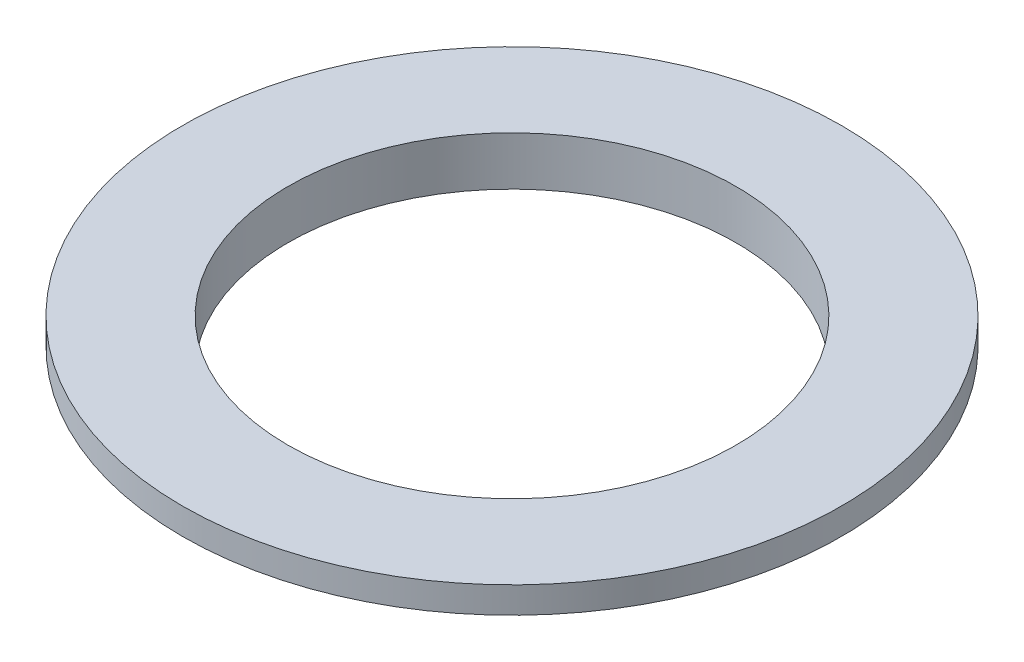
ISO-10303-21;
HEADER;
FILE_DESCRIPTION(('STEP AP214'),'2;1');
FILE_NAME('part.step','',(''),(''),'','','');
FILE_SCHEMA(('AUTOMOTIVE_DESIGN { 1 0 10303 214 1 1 1 1 }'));
ENDSEC;
DATA;
#1=APPLICATION_CONTEXT('core data for automotive mechanical design processes');
#2=APPLICATION_PROTOCOL_DEFINITION('international standard','automotive_design',2000,#1);
#3=PRODUCT_CONTEXT('',#1,'mechanical');
#4=PRODUCT('Part','Part','',(#3));
#5=PRODUCT_RELATED_PRODUCT_CATEGORY('part','',(#4));
#6=PRODUCT_DEFINITION_FORMATION('','',#4);
#7=PRODUCT_DEFINITION_CONTEXT('part definition',#1,'design');
#8=PRODUCT_DEFINITION('design','',#6,#7);
#9=PRODUCT_DEFINITION_SHAPE('','',#8);
#10=(LENGTH_UNIT() NAMED_UNIT(*) SI_UNIT(.MILLI.,.METRE.));
#11=(NAMED_UNIT(*) PLANE_ANGLE_UNIT() SI_UNIT($,.RADIAN.));
#12=(NAMED_UNIT(*) SI_UNIT($,.STERADIAN.) SOLID_ANGLE_UNIT());
#13=UNCERTAINTY_MEASURE_WITH_UNIT(LENGTH_MEASURE(1.E-05),#10,'distance_accuracy_value','');
#14=(GEOMETRIC_REPRESENTATION_CONTEXT(3) GLOBAL_UNCERTAINTY_ASSIGNED_CONTEXT((#13)) GLOBAL_UNIT_ASSIGNED_CONTEXT((#10,
#11,#12)) REPRESENTATION_CONTEXT('',''));
#15=CARTESIAN_POINT('',(0.,0.,0.));
#16=DIRECTION('',(0.,0.,1.));
#17=DIRECTION('',(1.,0.,0.));
#18=AXIS2_PLACEMENT_3D('',#15,#16,#17);
#19=CARTESIAN_POINT('',(0.,1.27,0.));
#20=DIRECTION('',(0.,-1.,0.));
#21=DIRECTION('',(0.,0.,-1.));
#22=AXIS2_PLACEMENT_3D('',#19,#20,#21);
#23=CYLINDRICAL_SURFACE('',#22,21.59);
#24=CARTESIAN_POINT('',(0.,1.27,0.));
#25=DIRECTION('',(0.,1.,0.));
#26=DIRECTION('',(0.,0.,1.));
#27=AXIS2_PLACEMENT_3D('',#24,#25,#26);
#28=CIRCLE('',#27,21.59);
#29=CARTESIAN_POINT('',(0.,1.27,21.59));
#30=VERTEX_POINT('',#29);
#31=EDGE_CURVE('E46',#30,#30,#28,.T.);
#32=ORIENTED_EDGE('',*,*,#31,.T.);
#33=EDGE_LOOP('',(#32));
#34=FACE_BOUND('',#33,.T.);
#35=CARTESIAN_POINT('',(0.,-3.429,0.));
#36=DIRECTION('',(0.,1.,0.));
#37=DIRECTION('',(0.,0.,1.));
#38=AXIS2_PLACEMENT_3D('',#35,#36,#37);
#39=CIRCLE('',#38,21.59);
#40=CARTESIAN_POINT('',(0.,-3.429,21.59));
#41=VERTEX_POINT('',#40);
#42=EDGE_CURVE('E56',#41,#41,#39,.T.);
#43=ORIENTED_EDGE('',*,*,#42,.F.);
#44=EDGE_LOOP('',(#43));
#45=FACE_BOUND('',#44,.T.);
#46=ADVANCED_FACE('F39',(#34,#45),#23,.F.);
#47=CARTESIAN_POINT('',(0.,1.27,0.));
#48=DIRECTION('',(0.,-1.,0.));
#49=DIRECTION('',(0.,0.,-1.));
#50=AXIS2_PLACEMENT_3D('',#47,#48,#49);
#51=CYLINDRICAL_SURFACE('',#50,31.75);
#52=CARTESIAN_POINT('',(0.,1.27,0.));
#53=DIRECTION('',(0.,1.,0.));
#54=DIRECTION('',(0.,0.,1.));
#55=AXIS2_PLACEMENT_3D('',#52,#53,#54);
#56=CIRCLE('',#55,31.75);
#57=CARTESIAN_POINT('',(0.,1.27,31.75));
#58=VERTEX_POINT('',#57);
#59=EDGE_CURVE('E11',#58,#58,#56,.T.);
#60=ORIENTED_EDGE('',*,*,#59,.F.);
#61=EDGE_LOOP('',(#60));
#62=FACE_BOUND('',#61,.T.);
#63=CARTESIAN_POINT('',(0.,-1.27,0.));
#64=DIRECTION('',(0.,1.,0.));
#65=DIRECTION('',(0.,0.,1.));
#66=AXIS2_PLACEMENT_3D('',#63,#64,#65);
#67=CIRCLE('',#66,31.75);
#68=CARTESIAN_POINT('',(0.,-1.27,31.75));
#69=VERTEX_POINT('',#68);
#70=EDGE_CURVE('E42',#69,#69,#67,.T.);
#71=ORIENTED_EDGE('',*,*,#70,.T.);
#72=EDGE_LOOP('',(#71));
#73=FACE_BOUND('',#72,.T.);
#74=ADVANCED_FACE('F66',(#62,#73),#51,.T.);
#75=CARTESIAN_POINT('',(0.,1.27,0.));
#76=DIRECTION('',(0.,1.,0.));
#77=DIRECTION('',(0.,0.,1.));
#78=AXIS2_PLACEMENT_3D('',#75,#76,#77);
#79=PLANE('',#78);
#80=ORIENTED_EDGE('',*,*,#31,.F.);
#81=EDGE_LOOP('',(#80));
#82=FACE_BOUND('',#81,.T.);
#83=ORIENTED_EDGE('',*,*,#59,.T.);
#84=EDGE_LOOP('',(#83));
#85=FACE_BOUND('',#84,.T.);
#86=ADVANCED_FACE('F71',(#82,#85),#79,.T.);
#87=CARTESIAN_POINT('',(0.,-1.27,0.));
#88=DIRECTION('',(0.,1.,0.));
#89=DIRECTION('',(0.,0.,1.));
#90=AXIS2_PLACEMENT_3D('',#87,#88,#89);
#91=PLANE('',#90);
#92=CARTESIAN_POINT('',(0.,-1.27,0.));
#93=DIRECTION('',(0.,1.,0.));
#94=DIRECTION('',(0.,0.,1.));
#95=AXIS2_PLACEMENT_3D('',#92,#93,#94);
#96=CIRCLE('',#95,25.4);
#97=CARTESIAN_POINT('',(0.,-1.27,25.4));
#98=VERTEX_POINT('',#97);
#99=EDGE_CURVE('E52',#98,#98,#96,.T.);
#100=ORIENTED_EDGE('',*,*,#99,.T.);
#101=EDGE_LOOP('',(#100));
#102=FACE_BOUND('',#101,.T.);
#103=ORIENTED_EDGE('',*,*,#70,.F.);
#104=EDGE_LOOP('',(#103));
#105=FACE_BOUND('',#104,.T.);
#106=ADVANCED_FACE('F76',(#102,#105),#91,.F.);
#107=CARTESIAN_POINT('',(0.,-3.429,0.));
#108=DIRECTION('',(0.,1.,0.));
#109=DIRECTION('',(0.,0.,1.));
#110=AXIS2_PLACEMENT_3D('',#107,#108,#109);
#111=CYLINDRICAL_SURFACE('',#110,25.4);
#112=CARTESIAN_POINT('',(0.,-3.429,0.));
#113=DIRECTION('',(0.,1.,0.));
#114=DIRECTION('',(0.,0.,1.));
#115=AXIS2_PLACEMENT_3D('',#112,#113,#114);
#116=CIRCLE('',#115,25.4);
#117=CARTESIAN_POINT('',(0.,-3.429,25.4));
#118=VERTEX_POINT('',#117);
#119=EDGE_CURVE('E55',#118,#118,#116,.T.);
#120=ORIENTED_EDGE('',*,*,#119,.T.);
#121=EDGE_LOOP('',(#120));
#122=FACE_BOUND('',#121,.T.);
#123=ORIENTED_EDGE('',*,*,#99,.F.);
#124=EDGE_LOOP('',(#123));
#125=FACE_BOUND('',#124,.T.);
#126=ADVANCED_FACE('F81',(#122,#125),#111,.T.);
#127=CARTESIAN_POINT('',(0.,-3.429,0.));
#128=DIRECTION('',(0.,1.,0.));
#129=DIRECTION('',(0.,0.,1.));
#130=AXIS2_PLACEMENT_3D('',#127,#128,#129);
#131=PLANE('',#130);
#132=ORIENTED_EDGE('',*,*,#42,.T.);
#133=EDGE_LOOP('',(#132));
#134=FACE_BOUND('',#133,.T.);
#135=ORIENTED_EDGE('',*,*,#119,.F.);
#136=EDGE_LOOP('',(#135));
#137=FACE_BOUND('',#136,.T.);
#138=ADVANCED_FACE('F62',(#134,#137),#131,.F.);
#139=CLOSED_SHELL('',(#46,#74,#86,#106,#126,#138));
#140=MANIFOLD_SOLID_BREP('B2',#139);
#141=ADVANCED_BREP_SHAPE_REPRESENTATION('',(#18,#140),#14);
#142=SHAPE_DEFINITION_REPRESENTATION(#9,#141);
ENDSEC;
END-ISO-10303-21;
